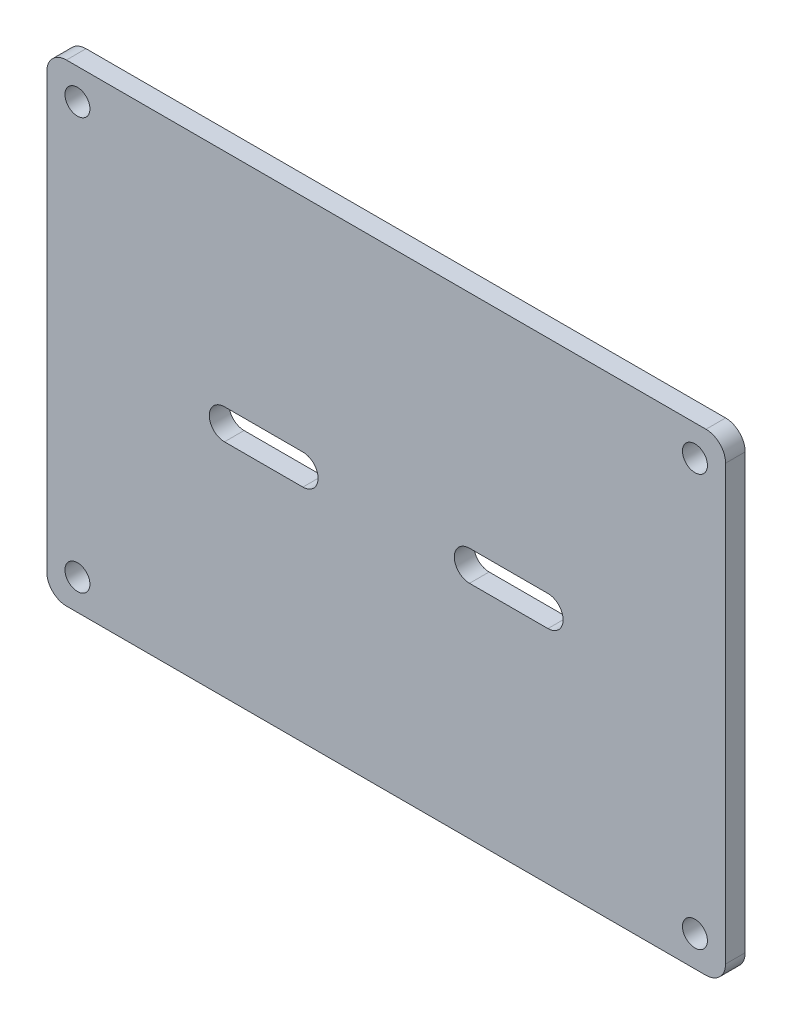
ISO-10303-21;
HEADER;
FILE_DESCRIPTION(('STEP AP214'),'2;1');
FILE_NAME('part.step','',(''),(''),'','','');
FILE_SCHEMA(('AUTOMOTIVE_DESIGN { 1 0 10303 214 1 1 1 1 }'));
ENDSEC;
DATA;
#1=APPLICATION_CONTEXT('core data for automotive mechanical design processes');
#2=APPLICATION_PROTOCOL_DEFINITION('international standard','automotive_design',2000,#1);
#3=PRODUCT_CONTEXT('',#1,'mechanical');
#4=PRODUCT('Part','Part','',(#3));
#5=PRODUCT_RELATED_PRODUCT_CATEGORY('part','',(#4));
#6=PRODUCT_DEFINITION_FORMATION('','',#4);
#7=PRODUCT_DEFINITION_CONTEXT('part definition',#1,'design');
#8=PRODUCT_DEFINITION('design','',#6,#7);
#9=PRODUCT_DEFINITION_SHAPE('','',#8);
#10=(LENGTH_UNIT() NAMED_UNIT(*) SI_UNIT(.MILLI.,.METRE.));
#11=(NAMED_UNIT(*) PLANE_ANGLE_UNIT() SI_UNIT($,.RADIAN.));
#12=(NAMED_UNIT(*) SI_UNIT($,.STERADIAN.) SOLID_ANGLE_UNIT());
#13=UNCERTAINTY_MEASURE_WITH_UNIT(LENGTH_MEASURE(1.E-05),#10,'distance_accuracy_value','');
#14=(GEOMETRIC_REPRESENTATION_CONTEXT(3) GLOBAL_UNCERTAINTY_ASSIGNED_CONTEXT((#13)) GLOBAL_UNIT_ASSIGNED_CONTEXT((#10,
#11,#12)) REPRESENTATION_CONTEXT('',''));
#15=CARTESIAN_POINT('',(0.,0.,0.));
#16=DIRECTION('',(0.,0.,1.));
#17=DIRECTION('',(1.,0.,0.));
#18=AXIS2_PLACEMENT_3D('',#15,#16,#17);
#19=CARTESIAN_POINT('',(0.,0.,2.));
#20=DIRECTION('',(0.,0.,1.));
#21=DIRECTION('',(1.,0.,0.));
#22=AXIS2_PLACEMENT_3D('',#19,#20,#21);
#23=PLANE('',#22);
#24=CARTESIAN_POINT('',(-31.5,-21.,2.));
#25=DIRECTION('',(0.,0.,1.));
#26=DIRECTION('',(1.,0.,0.));
#27=AXIS2_PLACEMENT_3D('',#24,#25,#26);
#28=CIRCLE('',#27,1.275);
#29=CARTESIAN_POINT('',(-30.225,-21.,2.));
#30=VERTEX_POINT('',#29);
#31=EDGE_CURVE('E228',#30,#30,#28,.T.);
#32=ORIENTED_EDGE('',*,*,#31,.F.);
#33=EDGE_LOOP('',(#32));
#34=FACE_BOUND('',#33,.T.);
#35=CARTESIAN_POINT('',(-31.5,21.,2.));
#36=DIRECTION('',(0.,0.,1.));
#37=DIRECTION('',(1.,0.,0.));
#38=AXIS2_PLACEMENT_3D('',#35,#36,#37);
#39=CIRCLE('',#38,1.275);
#40=CARTESIAN_POINT('',(-30.225,21.,2.));
#41=VERTEX_POINT('',#40);
#42=EDGE_CURVE('E240',#41,#41,#39,.T.);
#43=ORIENTED_EDGE('',*,*,#42,.F.);
#44=EDGE_LOOP('',(#43));
#45=FACE_BOUND('',#44,.T.);
#46=DIRECTION('',(-1.,0.,0.));
#47=VECTOR('',#46,1.);
#48=CARTESIAN_POINT('',(34.625,24.125,2.));
#49=LINE('',#48,#47);
#50=CARTESIAN_POINT('',(32.625,24.125,2.));
#51=VERTEX_POINT('',#50);
#52=CARTESIAN_POINT('',(-32.625,24.125,2.));
#53=VERTEX_POINT('',#52);
#54=EDGE_CURVE('E254',#51,#53,#49,.T.);
#55=ORIENTED_EDGE('',*,*,#54,.T.);
#56=CARTESIAN_POINT('',(-32.625,22.125,2.));
#57=DIRECTION('',(0.,0.,1.));
#58=DIRECTION('',(1.,0.,0.));
#59=AXIS2_PLACEMENT_3D('',#56,#57,#58);
#60=CIRCLE('',#59,2.);
#61=CARTESIAN_POINT('',(-34.625,22.125,2.));
#62=VERTEX_POINT('',#61);
#63=EDGE_CURVE('E289',#53,#62,#60,.T.);
#64=ORIENTED_EDGE('',*,*,#63,.T.);
#65=DIRECTION('',(0.,-1.,0.));
#66=VECTOR('',#65,1.);
#67=CARTESIAN_POINT('',(-34.625,-24.125,2.));
#68=LINE('',#67,#66);
#69=CARTESIAN_POINT('',(-34.625,-22.125,2.));
#70=VERTEX_POINT('',#69);
#71=EDGE_CURVE('E246',#62,#70,#68,.T.);
#72=ORIENTED_EDGE('',*,*,#71,.T.);
#73=CARTESIAN_POINT('',(-32.625,-22.125,2.));
#74=DIRECTION('',(0.,0.,1.));
#75=DIRECTION('',(1.,0.,0.));
#76=AXIS2_PLACEMENT_3D('',#73,#74,#75);
#77=CIRCLE('',#76,2.);
#78=CARTESIAN_POINT('',(-32.625,-24.125,2.));
#79=VERTEX_POINT('',#78);
#80=EDGE_CURVE('E286',#70,#79,#77,.T.);
#81=ORIENTED_EDGE('',*,*,#80,.T.);
#82=DIRECTION('',(1.,0.,0.));
#83=VECTOR('',#82,1.);
#84=CARTESIAN_POINT('',(34.625,-24.125,2.));
#85=LINE('',#84,#83);
#86=CARTESIAN_POINT('',(32.625,-24.125,2.));
#87=VERTEX_POINT('',#86);
#88=EDGE_CURVE('E249',#79,#87,#85,.T.);
#89=ORIENTED_EDGE('',*,*,#88,.T.);
#90=CARTESIAN_POINT('',(32.625,-22.125,2.));
#91=DIRECTION('',(0.,0.,1.));
#92=DIRECTION('',(1.,0.,0.));
#93=AXIS2_PLACEMENT_3D('',#90,#91,#92);
#94=CIRCLE('',#93,2.);
#95=CARTESIAN_POINT('',(34.625,-22.125,2.));
#96=VERTEX_POINT('',#95);
#97=EDGE_CURVE('E57',#87,#96,#94,.T.);
#98=ORIENTED_EDGE('',*,*,#97,.T.);
#99=DIRECTION('',(0.,1.,0.));
#100=VECTOR('',#99,1.);
#101=CARTESIAN_POINT('',(34.625,-24.125,2.));
#102=LINE('',#101,#100);
#103=CARTESIAN_POINT('',(34.625,22.125,2.));
#104=VERTEX_POINT('',#103);
#105=EDGE_CURVE('E252',#96,#104,#102,.T.);
#106=ORIENTED_EDGE('',*,*,#105,.T.);
#107=CARTESIAN_POINT('',(32.625,22.125,2.));
#108=DIRECTION('',(0.,0.,1.));
#109=DIRECTION('',(1.,0.,0.));
#110=AXIS2_PLACEMENT_3D('',#107,#108,#109);
#111=CIRCLE('',#110,2.);
#112=EDGE_CURVE('E284',#104,#51,#111,.T.);
#113=ORIENTED_EDGE('',*,*,#112,.T.);
#114=EDGE_LOOP('',(#55,#64,#72,#81,#89,#98,#106,#113));
#115=FACE_BOUND('',#114,.T.);
#116=CARTESIAN_POINT('',(31.5,21.,2.));
#117=DIRECTION('',(0.,0.,1.));
#118=DIRECTION('',(1.,0.,0.));
#119=AXIS2_PLACEMENT_3D('',#116,#117,#118);
#120=CIRCLE('',#119,1.275);
#121=CARTESIAN_POINT('',(32.775,21.,2.));
#122=VERTEX_POINT('',#121);
#123=EDGE_CURVE('E234',#122,#122,#120,.T.);
#124=ORIENTED_EDGE('',*,*,#123,.F.);
#125=EDGE_LOOP('',(#124));
#126=FACE_BOUND('',#125,.T.);
#127=CARTESIAN_POINT('',(31.5,-21.,2.));
#128=DIRECTION('',(0.,0.,1.));
#129=DIRECTION('',(1.,0.,0.));
#130=AXIS2_PLACEMENT_3D('',#127,#128,#129);
#131=CIRCLE('',#130,1.275);
#132=CARTESIAN_POINT('',(32.775,-21.,2.));
#133=VERTEX_POINT('',#132);
#134=EDGE_CURVE('E222',#133,#133,#131,.T.);
#135=ORIENTED_EDGE('',*,*,#134,.F.);
#136=EDGE_LOOP('',(#135));
#137=FACE_BOUND('',#136,.T.);
#138=DIRECTION('',(1.,0.,0.));
#139=VECTOR('',#138,1.);
#140=CARTESIAN_POINT('',(-16.5,-1.55,2.));
#141=LINE('',#140,#139);
#142=CARTESIAN_POINT('',(-16.5,-1.55,2.));
#143=VERTEX_POINT('',#142);
#144=CARTESIAN_POINT('',(-8.5,-1.55,2.));
#145=VERTEX_POINT('',#144);
#146=EDGE_CURVE('E193',#143,#145,#141,.T.);
#147=ORIENTED_EDGE('',*,*,#146,.F.);
#148=CARTESIAN_POINT('',(-16.5,0.,2.));
#149=DIRECTION('',(0.,0.,1.));
#150=DIRECTION('',(1.,0.,0.));
#151=AXIS2_PLACEMENT_3D('',#148,#149,#150);
#152=CIRCLE('',#151,1.55);
#153=CARTESIAN_POINT('',(-16.5,1.55,2.));
#154=VERTEX_POINT('',#153);
#155=EDGE_CURVE('E191',#154,#143,#152,.T.);
#156=ORIENTED_EDGE('',*,*,#155,.F.);
#157=DIRECTION('',(-1.,0.,0.));
#158=VECTOR('',#157,1.);
#159=CARTESIAN_POINT('',(-16.5,1.55,2.));
#160=LINE('',#159,#158);
#161=CARTESIAN_POINT('',(-8.5,1.55,2.));
#162=VERTEX_POINT('',#161);
#163=EDGE_CURVE('E199',#162,#154,#160,.T.);
#164=ORIENTED_EDGE('',*,*,#163,.F.);
#165=CARTESIAN_POINT('',(-8.5,0.,2.));
#166=DIRECTION('',(0.,0.,1.));
#167=DIRECTION('',(1.,0.,0.));
#168=AXIS2_PLACEMENT_3D('',#165,#166,#167);
#169=CIRCLE('',#168,1.55);
#170=EDGE_CURVE('E196',#145,#162,#169,.T.);
#171=ORIENTED_EDGE('',*,*,#170,.F.);
#172=EDGE_LOOP('',(#147,#156,#164,#171));
#173=FACE_BOUND('',#172,.T.);
#174=DIRECTION('',(-1.,0.,0.));
#175=VECTOR('',#174,1.);
#176=CARTESIAN_POINT('',(16.5,1.55,2.));
#177=LINE('',#176,#175);
#178=CARTESIAN_POINT('',(16.5,1.55,2.));
#179=VERTEX_POINT('',#178);
#180=CARTESIAN_POINT('',(8.5,1.55,2.));
#181=VERTEX_POINT('',#180);
#182=EDGE_CURVE('E160',#179,#181,#177,.T.);
#183=ORIENTED_EDGE('',*,*,#182,.F.);
#184=CARTESIAN_POINT('',(16.5,0.,2.));
#185=DIRECTION('',(0.,0.,1.));
#186=DIRECTION('',(1.,0.,0.));
#187=AXIS2_PLACEMENT_3D('',#184,#185,#186);
#188=CIRCLE('',#187,1.55);
#189=CARTESIAN_POINT('',(16.5,-1.55,2.));
#190=VERTEX_POINT('',#189);
#191=EDGE_CURVE('E150',#190,#179,#188,.T.);
#192=ORIENTED_EDGE('',*,*,#191,.F.);
#193=DIRECTION('',(1.,0.,0.));
#194=VECTOR('',#193,1.);
#195=CARTESIAN_POINT('',(16.5,-1.55,2.));
#196=LINE('',#195,#194);
#197=CARTESIAN_POINT('',(8.5,-1.55,2.));
#198=VERTEX_POINT('',#197);
#199=EDGE_CURVE('E175',#198,#190,#196,.T.);
#200=ORIENTED_EDGE('',*,*,#199,.F.);
#201=CARTESIAN_POINT('',(8.5,0.,2.));
#202=DIRECTION('',(0.,0.,1.));
#203=DIRECTION('',(1.,0.,0.));
#204=AXIS2_PLACEMENT_3D('',#201,#202,#203);
#205=CIRCLE('',#204,1.55);
#206=EDGE_CURVE('E173',#181,#198,#205,.T.);
#207=ORIENTED_EDGE('',*,*,#206,.F.);
#208=EDGE_LOOP('',(#183,#192,#200,#207));
#209=FACE_BOUND('',#208,.T.);
#210=ADVANCED_FACE('F35',(#34,#45,#115,#126,#137,#173,#209),#23,.T.);
#211=CARTESIAN_POINT('',(0.,0.,0.));
#212=DIRECTION('',(0.,0.,1.));
#213=DIRECTION('',(1.,0.,0.));
#214=AXIS2_PLACEMENT_3D('',#211,#212,#213);
#215=PLANE('',#214);
#216=CARTESIAN_POINT('',(-16.5,0.,0.));
#217=DIRECTION('',(0.,0.,1.));
#218=DIRECTION('',(1.,0.,0.));
#219=AXIS2_PLACEMENT_3D('',#216,#217,#218);
#220=CIRCLE('',#219,1.55);
#221=CARTESIAN_POINT('',(-16.5,1.55,0.));
#222=VERTEX_POINT('',#221);
#223=CARTESIAN_POINT('',(-16.5,-1.55,0.));
#224=VERTEX_POINT('',#223);
#225=EDGE_CURVE('E168',#222,#224,#220,.T.);
#226=ORIENTED_EDGE('',*,*,#225,.T.);
#227=DIRECTION('',(1.,0.,0.));
#228=VECTOR('',#227,1.);
#229=CARTESIAN_POINT('',(-16.5,-1.55,0.));
#230=LINE('',#229,#228);
#231=CARTESIAN_POINT('',(-8.5,-1.55,0.));
#232=VERTEX_POINT('',#231);
#233=EDGE_CURVE('E204',#224,#232,#230,.T.);
#234=ORIENTED_EDGE('',*,*,#233,.T.);
#235=CARTESIAN_POINT('',(-8.5,0.,0.));
#236=DIRECTION('',(0.,0.,1.));
#237=DIRECTION('',(1.,0.,0.));
#238=AXIS2_PLACEMENT_3D('',#235,#236,#237);
#239=CIRCLE('',#238,1.55);
#240=CARTESIAN_POINT('',(-8.5,1.55,0.));
#241=VERTEX_POINT('',#240);
#242=EDGE_CURVE('E207',#232,#241,#239,.T.);
#243=ORIENTED_EDGE('',*,*,#242,.T.);
#244=DIRECTION('',(-1.,0.,0.));
#245=VECTOR('',#244,1.);
#246=CARTESIAN_POINT('',(-16.5,1.55,0.));
#247=LINE('',#246,#245);
#248=EDGE_CURVE('E194',#241,#222,#247,.T.);
#249=ORIENTED_EDGE('',*,*,#248,.T.);
#250=EDGE_LOOP('',(#226,#234,#243,#249));
#251=FACE_BOUND('',#250,.T.);
#252=DIRECTION('',(0.,-1.,0.));
#253=VECTOR('',#252,1.);
#254=CARTESIAN_POINT('',(-34.625,-24.125,0.));
#255=LINE('',#254,#253);
#256=CARTESIAN_POINT('',(-34.625,22.125,0.));
#257=VERTEX_POINT('',#256);
#258=CARTESIAN_POINT('',(-34.625,-22.125,0.));
#259=VERTEX_POINT('',#258);
#260=EDGE_CURVE('E243',#257,#259,#255,.T.);
#261=ORIENTED_EDGE('',*,*,#260,.F.);
#262=CARTESIAN_POINT('',(-32.625,22.125,0.));
#263=DIRECTION('',(0.,0.,1.));
#264=DIRECTION('',(1.,0.,0.));
#265=AXIS2_PLACEMENT_3D('',#262,#263,#264);
#266=CIRCLE('',#265,2.);
#267=CARTESIAN_POINT('',(-32.625,24.125,0.));
#268=VERTEX_POINT('',#267);
#269=EDGE_CURVE('E277',#257,#268,#266,.F.);
#270=ORIENTED_EDGE('',*,*,#269,.T.);
#271=DIRECTION('',(-1.,0.,0.));
#272=VECTOR('',#271,1.);
#273=CARTESIAN_POINT('',(34.625,24.125,0.));
#274=LINE('',#273,#272);
#275=CARTESIAN_POINT('',(32.625,24.125,0.));
#276=VERTEX_POINT('',#275);
#277=EDGE_CURVE('E250',#276,#268,#274,.T.);
#278=ORIENTED_EDGE('',*,*,#277,.F.);
#279=CARTESIAN_POINT('',(32.625,22.125,0.));
#280=DIRECTION('',(0.,0.,1.));
#281=DIRECTION('',(1.,0.,0.));
#282=AXIS2_PLACEMENT_3D('',#279,#280,#281);
#283=CIRCLE('',#282,2.);
#284=CARTESIAN_POINT('',(34.625,22.125,0.));
#285=VERTEX_POINT('',#284);
#286=EDGE_CURVE('E271',#276,#285,#283,.F.);
#287=ORIENTED_EDGE('',*,*,#286,.T.);
#288=DIRECTION('',(0.,1.,0.));
#289=VECTOR('',#288,1.);
#290=CARTESIAN_POINT('',(34.625,-24.125,0.));
#291=LINE('',#290,#289);
#292=CARTESIAN_POINT('',(34.625,-22.125,0.));
#293=VERTEX_POINT('',#292);
#294=EDGE_CURVE('E263',#293,#285,#291,.T.);
#295=ORIENTED_EDGE('',*,*,#294,.F.);
#296=CARTESIAN_POINT('',(32.625,-22.125,0.));
#297=DIRECTION('',(0.,0.,1.));
#298=DIRECTION('',(1.,0.,0.));
#299=AXIS2_PLACEMENT_3D('',#296,#297,#298);
#300=CIRCLE('',#299,2.);
#301=CARTESIAN_POINT('',(32.625,-24.125,0.));
#302=VERTEX_POINT('',#301);
#303=EDGE_CURVE('E275',#293,#302,#300,.F.);
#304=ORIENTED_EDGE('',*,*,#303,.T.);
#305=DIRECTION('',(1.,0.,0.));
#306=VECTOR('',#305,1.);
#307=CARTESIAN_POINT('',(34.625,-24.125,0.));
#308=LINE('',#307,#306);
#309=CARTESIAN_POINT('',(-32.625,-24.125,0.));
#310=VERTEX_POINT('',#309);
#311=EDGE_CURVE('E260',#310,#302,#308,.T.);
#312=ORIENTED_EDGE('',*,*,#311,.F.);
#313=CARTESIAN_POINT('',(-32.625,-22.125,0.));
#314=DIRECTION('',(0.,0.,1.));
#315=DIRECTION('',(1.,0.,0.));
#316=AXIS2_PLACEMENT_3D('',#313,#314,#315);
#317=CIRCLE('',#316,2.);
#318=EDGE_CURVE('E273',#310,#259,#317,.F.);
#319=ORIENTED_EDGE('',*,*,#318,.T.);
#320=EDGE_LOOP('',(#261,#270,#278,#287,#295,#304,#312,#319));
#321=FACE_BOUND('',#320,.T.);
#322=CARTESIAN_POINT('',(-31.5,21.,0.));
#323=DIRECTION('',(0.,0.,1.));
#324=DIRECTION('',(1.,0.,0.));
#325=AXIS2_PLACEMENT_3D('',#322,#323,#324);
#326=CIRCLE('',#325,1.275);
#327=CARTESIAN_POINT('',(-30.225,21.,0.));
#328=VERTEX_POINT('',#327);
#329=EDGE_CURVE('E237',#328,#328,#326,.T.);
#330=ORIENTED_EDGE('',*,*,#329,.T.);
#331=EDGE_LOOP('',(#330));
#332=FACE_BOUND('',#331,.T.);
#333=CARTESIAN_POINT('',(31.5,21.,0.));
#334=DIRECTION('',(0.,0.,1.));
#335=DIRECTION('',(1.,0.,0.));
#336=AXIS2_PLACEMENT_3D('',#333,#334,#335);
#337=CIRCLE('',#336,1.275);
#338=CARTESIAN_POINT('',(32.775,21.,0.));
#339=VERTEX_POINT('',#338);
#340=EDGE_CURVE('E231',#339,#339,#337,.T.);
#341=ORIENTED_EDGE('',*,*,#340,.T.);
#342=EDGE_LOOP('',(#341));
#343=FACE_BOUND('',#342,.T.);
#344=CARTESIAN_POINT('',(-31.5,-21.,0.));
#345=DIRECTION('',(0.,0.,1.));
#346=DIRECTION('',(1.,0.,0.));
#347=AXIS2_PLACEMENT_3D('',#344,#345,#346);
#348=CIRCLE('',#347,1.275);
#349=CARTESIAN_POINT('',(-30.225,-21.,0.));
#350=VERTEX_POINT('',#349);
#351=EDGE_CURVE('E225',#350,#350,#348,.T.);
#352=ORIENTED_EDGE('',*,*,#351,.T.);
#353=EDGE_LOOP('',(#352));
#354=FACE_BOUND('',#353,.T.);
#355=CARTESIAN_POINT('',(31.5,-21.,0.));
#356=DIRECTION('',(0.,0.,1.));
#357=DIRECTION('',(1.,0.,0.));
#358=AXIS2_PLACEMENT_3D('',#355,#356,#357);
#359=CIRCLE('',#358,1.275);
#360=CARTESIAN_POINT('',(32.775,-21.,0.));
#361=VERTEX_POINT('',#360);
#362=EDGE_CURVE('E221',#361,#361,#359,.T.);
#363=ORIENTED_EDGE('',*,*,#362,.T.);
#364=EDGE_LOOP('',(#363));
#365=FACE_BOUND('',#364,.T.);
#366=CARTESIAN_POINT('',(16.5,0.,0.));
#367=DIRECTION('',(0.,0.,1.));
#368=DIRECTION('',(1.,0.,0.));
#369=AXIS2_PLACEMENT_3D('',#366,#367,#368);
#370=CIRCLE('',#369,1.55);
#371=CARTESIAN_POINT('',(16.5,-1.55,0.));
#372=VERTEX_POINT('',#371);
#373=CARTESIAN_POINT('',(16.5,1.55,0.));
#374=VERTEX_POINT('',#373);
#375=EDGE_CURVE('E179',#372,#374,#370,.T.);
#376=ORIENTED_EDGE('',*,*,#375,.T.);
#377=DIRECTION('',(-1.,0.,0.));
#378=VECTOR('',#377,1.);
#379=CARTESIAN_POINT('',(16.5,1.55,0.));
#380=LINE('',#379,#378);
#381=CARTESIAN_POINT('',(8.5,1.55,0.));
#382=VERTEX_POINT('',#381);
#383=EDGE_CURVE('E167',#374,#382,#380,.T.);
#384=ORIENTED_EDGE('',*,*,#383,.T.);
#385=CARTESIAN_POINT('',(8.5,0.,0.));
#386=DIRECTION('',(0.,0.,1.));
#387=DIRECTION('',(1.,0.,0.));
#388=AXIS2_PLACEMENT_3D('',#385,#386,#387);
#389=CIRCLE('',#388,1.55);
#390=CARTESIAN_POINT('',(8.5,-1.55,0.));
#391=VERTEX_POINT('',#390);
#392=EDGE_CURVE('E182',#382,#391,#389,.T.);
#393=ORIENTED_EDGE('',*,*,#392,.T.);
#394=DIRECTION('',(1.,0.,0.));
#395=VECTOR('',#394,1.);
#396=CARTESIAN_POINT('',(16.5,-1.55,0.));
#397=LINE('',#396,#395);
#398=EDGE_CURVE('E161',#391,#372,#397,.T.);
#399=ORIENTED_EDGE('',*,*,#398,.T.);
#400=EDGE_LOOP('',(#376,#384,#393,#399));
#401=FACE_BOUND('',#400,.T.);
#402=ADVANCED_FACE('F305',(#251,#321,#332,#343,#354,#365,#401),#215,.F.);
#403=CARTESIAN_POINT('',(-34.625,-24.125,2.));
#404=DIRECTION('',(1.,0.,0.));
#405=DIRECTION('',(0.,0.,-1.));
#406=AXIS2_PLACEMENT_3D('',#403,#404,#405);
#407=PLANE('',#406);
#408=ORIENTED_EDGE('',*,*,#71,.F.);
#409=DIRECTION('',(0.,0.,-1.));
#410=VECTOR('',#409,1.);
#411=CARTESIAN_POINT('',(-34.625,22.125,2.));
#412=LINE('',#411,#410);
#413=EDGE_CURVE('E268',#62,#257,#412,.T.);
#414=ORIENTED_EDGE('',*,*,#413,.T.);
#415=ORIENTED_EDGE('',*,*,#260,.T.);
#416=DIRECTION('',(0.,0.,-1.));
#417=VECTOR('',#416,1.);
#418=CARTESIAN_POINT('',(-34.625,-22.125,2.));
#419=LINE('',#418,#417);
#420=EDGE_CURVE('E257',#259,#70,#419,.F.);
#421=ORIENTED_EDGE('',*,*,#420,.T.);
#422=EDGE_LOOP('',(#408,#414,#415,#421));
#423=FACE_BOUND('',#422,.T.);
#424=ADVANCED_FACE('F327',(#423),#407,.F.);
#425=CARTESIAN_POINT('',(34.625,-24.125,2.));
#426=DIRECTION('',(0.,1.,0.));
#427=DIRECTION('',(0.,0.,1.));
#428=AXIS2_PLACEMENT_3D('',#425,#426,#427);
#429=PLANE('',#428);
#430=ORIENTED_EDGE('',*,*,#311,.T.);
#431=DIRECTION('',(0.,0.,-1.));
#432=VECTOR('',#431,1.);
#433=CARTESIAN_POINT('',(32.625,-24.125,2.));
#434=LINE('',#433,#432);
#435=EDGE_CURVE('E11',#302,#87,#434,.F.);
#436=ORIENTED_EDGE('',*,*,#435,.T.);
#437=ORIENTED_EDGE('',*,*,#88,.F.);
#438=DIRECTION('',(0.,0.,-1.));
#439=VECTOR('',#438,1.);
#440=CARTESIAN_POINT('',(-32.625,-24.125,2.));
#441=LINE('',#440,#439);
#442=EDGE_CURVE('E43',#79,#310,#441,.T.);
#443=ORIENTED_EDGE('',*,*,#442,.T.);
#444=EDGE_LOOP('',(#430,#436,#437,#443));
#445=FACE_BOUND('',#444,.T.);
#446=ADVANCED_FACE('F299',(#445),#429,.F.);
#447=CARTESIAN_POINT('',(34.625,-24.125,2.));
#448=DIRECTION('',(-1.,0.,0.));
#449=DIRECTION('',(0.,0.,1.));
#450=AXIS2_PLACEMENT_3D('',#447,#448,#449);
#451=PLANE('',#450);
#452=ORIENTED_EDGE('',*,*,#105,.F.);
#453=DIRECTION('',(0.,0.,-1.));
#454=VECTOR('',#453,1.);
#455=CARTESIAN_POINT('',(34.625,-22.125,2.));
#456=LINE('',#455,#454);
#457=EDGE_CURVE('E292',#96,#293,#456,.T.);
#458=ORIENTED_EDGE('',*,*,#457,.T.);
#459=ORIENTED_EDGE('',*,*,#294,.T.);
#460=DIRECTION('',(0.,0.,-1.));
#461=VECTOR('',#460,1.);
#462=CARTESIAN_POINT('',(34.625,22.125,2.));
#463=LINE('',#462,#461);
#464=EDGE_CURVE('E50',#285,#104,#463,.F.);
#465=ORIENTED_EDGE('',*,*,#464,.T.);
#466=EDGE_LOOP('',(#452,#458,#459,#465));
#467=FACE_BOUND('',#466,.T.);
#468=ADVANCED_FACE('F311',(#467),#451,.F.);
#469=CARTESIAN_POINT('',(34.625,24.125,2.));
#470=DIRECTION('',(0.,-1.,0.));
#471=DIRECTION('',(0.,0.,-1.));
#472=AXIS2_PLACEMENT_3D('',#469,#470,#471);
#473=PLANE('',#472);
#474=ORIENTED_EDGE('',*,*,#277,.T.);
#475=DIRECTION('',(0.,0.,-1.));
#476=VECTOR('',#475,1.);
#477=CARTESIAN_POINT('',(-32.625,24.125,2.));
#478=LINE('',#477,#476);
#479=EDGE_CURVE('E282',#268,#53,#478,.F.);
#480=ORIENTED_EDGE('',*,*,#479,.T.);
#481=ORIENTED_EDGE('',*,*,#54,.F.);
#482=DIRECTION('',(0.,0.,-1.));
#483=VECTOR('',#482,1.);
#484=CARTESIAN_POINT('',(32.625,24.125,2.));
#485=LINE('',#484,#483);
#486=EDGE_CURVE('E279',#51,#276,#485,.T.);
#487=ORIENTED_EDGE('',*,*,#486,.T.);
#488=EDGE_LOOP('',(#474,#480,#481,#487));
#489=FACE_BOUND('',#488,.T.);
#490=ADVANCED_FACE('F319',(#489),#473,.F.);
#491=CARTESIAN_POINT('',(-31.5,21.,2.));
#492=DIRECTION('',(0.,0.,-1.));
#493=DIRECTION('',(-1.,0.,0.));
#494=AXIS2_PLACEMENT_3D('',#491,#492,#493);
#495=CYLINDRICAL_SURFACE('',#494,1.275);
#496=ORIENTED_EDGE('',*,*,#42,.T.);
#497=EDGE_LOOP('',(#496));
#498=FACE_BOUND('',#497,.T.);
#499=ORIENTED_EDGE('',*,*,#329,.F.);
#500=EDGE_LOOP('',(#499));
#501=FACE_BOUND('',#500,.T.);
#502=ADVANCED_FACE('F347',(#498,#501),#495,.F.);
#503=CARTESIAN_POINT('',(31.5,21.,2.));
#504=DIRECTION('',(0.,0.,-1.));
#505=DIRECTION('',(-1.,0.,0.));
#506=AXIS2_PLACEMENT_3D('',#503,#504,#505);
#507=CYLINDRICAL_SURFACE('',#506,1.275);
#508=ORIENTED_EDGE('',*,*,#123,.T.);
#509=EDGE_LOOP('',(#508));
#510=FACE_BOUND('',#509,.T.);
#511=ORIENTED_EDGE('',*,*,#340,.F.);
#512=EDGE_LOOP('',(#511));
#513=FACE_BOUND('',#512,.T.);
#514=ADVANCED_FACE('F399',(#510,#513),#507,.F.);
#515=CARTESIAN_POINT('',(-31.5,-21.,2.));
#516=DIRECTION('',(0.,0.,-1.));
#517=DIRECTION('',(-1.,0.,0.));
#518=AXIS2_PLACEMENT_3D('',#515,#516,#517);
#519=CYLINDRICAL_SURFACE('',#518,1.275);
#520=ORIENTED_EDGE('',*,*,#31,.T.);
#521=EDGE_LOOP('',(#520));
#522=FACE_BOUND('',#521,.T.);
#523=ORIENTED_EDGE('',*,*,#351,.F.);
#524=EDGE_LOOP('',(#523));
#525=FACE_BOUND('',#524,.T.);
#526=ADVANCED_FACE('F396',(#522,#525),#519,.F.);
#527=CARTESIAN_POINT('',(31.5,-21.,2.));
#528=DIRECTION('',(0.,0.,-1.));
#529=DIRECTION('',(-1.,0.,0.));
#530=AXIS2_PLACEMENT_3D('',#527,#528,#529);
#531=CYLINDRICAL_SURFACE('',#530,1.275);
#532=ORIENTED_EDGE('',*,*,#134,.T.);
#533=EDGE_LOOP('',(#532));
#534=FACE_BOUND('',#533,.T.);
#535=ORIENTED_EDGE('',*,*,#362,.F.);
#536=EDGE_LOOP('',(#535));
#537=FACE_BOUND('',#536,.T.);
#538=ADVANCED_FACE('F392',(#534,#537),#531,.F.);
#539=CARTESIAN_POINT('',(-16.5,0.,2.));
#540=DIRECTION('',(0.,0.,-1.));
#541=DIRECTION('',(-1.,0.,0.));
#542=AXIS2_PLACEMENT_3D('',#539,#540,#541);
#543=CYLINDRICAL_SURFACE('',#542,1.55);
#544=ORIENTED_EDGE('',*,*,#225,.F.);
#545=DIRECTION('',(0.,0.,-1.));
#546=VECTOR('',#545,1.);
#547=CARTESIAN_POINT('',(-16.5,1.55,2.));
#548=LINE('',#547,#546);
#549=EDGE_CURVE('E201',#154,#222,#548,.T.);
#550=ORIENTED_EDGE('',*,*,#549,.F.);
#551=ORIENTED_EDGE('',*,*,#155,.T.);
#552=DIRECTION('',(0.,0.,-1.));
#553=VECTOR('',#552,1.);
#554=CARTESIAN_POINT('',(-16.5,-1.55,2.));
#555=LINE('',#554,#553);
#556=EDGE_CURVE('E218',#143,#224,#555,.T.);
#557=ORIENTED_EDGE('',*,*,#556,.T.);
#558=EDGE_LOOP('',(#544,#550,#551,#557));
#559=FACE_BOUND('',#558,.T.);
#560=ADVANCED_FACE('F388',(#559),#543,.F.);
#561=CARTESIAN_POINT('',(-16.5,-1.55,2.));
#562=DIRECTION('',(0.,1.,0.));
#563=DIRECTION('',(-1.,0.,0.));
#564=AXIS2_PLACEMENT_3D('',#561,#562,#563);
#565=PLANE('',#564);
#566=ORIENTED_EDGE('',*,*,#233,.F.);
#567=ORIENTED_EDGE('',*,*,#556,.F.);
#568=ORIENTED_EDGE('',*,*,#146,.T.);
#569=DIRECTION('',(0.,0.,-1.));
#570=VECTOR('',#569,1.);
#571=CARTESIAN_POINT('',(-8.5,-1.55,2.));
#572=LINE('',#571,#570);
#573=EDGE_CURVE('E216',#145,#232,#572,.T.);
#574=ORIENTED_EDGE('',*,*,#573,.T.);
#575=EDGE_LOOP('',(#566,#567,#568,#574));
#576=FACE_BOUND('',#575,.T.);
#577=ADVANCED_FACE('F384',(#576),#565,.T.);
#578=CARTESIAN_POINT('',(-8.5,0.,2.));
#579=DIRECTION('',(0.,0.,-1.));
#580=DIRECTION('',(-1.,0.,0.));
#581=AXIS2_PLACEMENT_3D('',#578,#579,#580);
#582=CYLINDRICAL_SURFACE('',#581,1.55);
#583=ORIENTED_EDGE('',*,*,#242,.F.);
#584=ORIENTED_EDGE('',*,*,#573,.F.);
#585=ORIENTED_EDGE('',*,*,#170,.T.);
#586=DIRECTION('',(0.,0.,-1.));
#587=VECTOR('',#586,1.);
#588=CARTESIAN_POINT('',(-8.5,1.55,2.));
#589=LINE('',#588,#587);
#590=EDGE_CURVE('E214',#162,#241,#589,.T.);
#591=ORIENTED_EDGE('',*,*,#590,.T.);
#592=EDGE_LOOP('',(#583,#584,#585,#591));
#593=FACE_BOUND('',#592,.T.);
#594=ADVANCED_FACE('F380',(#593),#582,.F.);
#595=CARTESIAN_POINT('',(-16.5,1.55,2.));
#596=DIRECTION('',(0.,-1.,0.));
#597=DIRECTION('',(1.,0.,0.));
#598=AXIS2_PLACEMENT_3D('',#595,#596,#597);
#599=PLANE('',#598);
#600=ORIENTED_EDGE('',*,*,#248,.F.);
#601=ORIENTED_EDGE('',*,*,#590,.F.);
#602=ORIENTED_EDGE('',*,*,#163,.T.);
#603=ORIENTED_EDGE('',*,*,#549,.T.);
#604=EDGE_LOOP('',(#600,#601,#602,#603));
#605=FACE_BOUND('',#604,.T.);
#606=ADVANCED_FACE('F377',(#605),#599,.T.);
#607=CARTESIAN_POINT('',(16.5,0.,2.));
#608=DIRECTION('',(0.,0.,-1.));
#609=DIRECTION('',(-1.,0.,0.));
#610=AXIS2_PLACEMENT_3D('',#607,#608,#609);
#611=CYLINDRICAL_SURFACE('',#610,1.55);
#612=ORIENTED_EDGE('',*,*,#375,.F.);
#613=DIRECTION('',(0.,0.,-1.));
#614=VECTOR('',#613,1.);
#615=CARTESIAN_POINT('',(16.5,-1.55,2.));
#616=LINE('',#615,#614);
#617=EDGE_CURVE('E156',#190,#372,#616,.T.);
#618=ORIENTED_EDGE('',*,*,#617,.F.);
#619=ORIENTED_EDGE('',*,*,#191,.T.);
#620=DIRECTION('',(0.,0.,-1.));
#621=VECTOR('',#620,1.);
#622=CARTESIAN_POINT('',(16.5,1.55,2.));
#623=LINE('',#622,#621);
#624=EDGE_CURVE('E153',#179,#374,#623,.T.);
#625=ORIENTED_EDGE('',*,*,#624,.T.);
#626=EDGE_LOOP('',(#612,#618,#619,#625));
#627=FACE_BOUND('',#626,.T.);
#628=ADVANCED_FACE('F152',(#627),#611,.F.);
#629=CARTESIAN_POINT('',(16.5,1.55,2.));
#630=DIRECTION('',(0.,-1.,0.));
#631=DIRECTION('',(1.,0.,0.));
#632=AXIS2_PLACEMENT_3D('',#629,#630,#631);
#633=PLANE('',#632);
#634=ORIENTED_EDGE('',*,*,#383,.F.);
#635=ORIENTED_EDGE('',*,*,#624,.F.);
#636=ORIENTED_EDGE('',*,*,#182,.T.);
#637=DIRECTION('',(0.,0.,-1.));
#638=VECTOR('',#637,1.);
#639=CARTESIAN_POINT('',(8.5,1.55,2.));
#640=LINE('',#639,#638);
#641=EDGE_CURVE('E169',#181,#382,#640,.T.);
#642=ORIENTED_EDGE('',*,*,#641,.T.);
#643=EDGE_LOOP('',(#634,#635,#636,#642));
#644=FACE_BOUND('',#643,.T.);
#645=ADVANCED_FACE('F164',(#644),#633,.T.);
#646=CARTESIAN_POINT('',(8.5,0.,2.));
#647=DIRECTION('',(0.,0.,-1.));
#648=DIRECTION('',(-1.,0.,0.));
#649=AXIS2_PLACEMENT_3D('',#646,#647,#648);
#650=CYLINDRICAL_SURFACE('',#649,1.55);
#651=ORIENTED_EDGE('',*,*,#392,.F.);
#652=ORIENTED_EDGE('',*,*,#641,.F.);
#653=ORIENTED_EDGE('',*,*,#206,.T.);
#654=DIRECTION('',(0.,0.,-1.));
#655=VECTOR('',#654,1.);
#656=CARTESIAN_POINT('',(8.5,-1.55,2.));
#657=LINE('',#656,#655);
#658=EDGE_CURVE('E188',#198,#391,#657,.T.);
#659=ORIENTED_EDGE('',*,*,#658,.T.);
#660=EDGE_LOOP('',(#651,#652,#653,#659));
#661=FACE_BOUND('',#660,.T.);
#662=ADVANCED_FACE('F363',(#661),#650,.F.);
#663=CARTESIAN_POINT('',(16.5,-1.55,2.));
#664=DIRECTION('',(0.,1.,0.));
#665=DIRECTION('',(-1.,0.,0.));
#666=AXIS2_PLACEMENT_3D('',#663,#664,#665);
#667=PLANE('',#666);
#668=ORIENTED_EDGE('',*,*,#398,.F.);
#669=ORIENTED_EDGE('',*,*,#658,.F.);
#670=ORIENTED_EDGE('',*,*,#199,.T.);
#671=ORIENTED_EDGE('',*,*,#617,.T.);
#672=EDGE_LOOP('',(#668,#669,#670,#671));
#673=FACE_BOUND('',#672,.T.);
#674=ADVANCED_FACE('F359',(#673),#667,.T.);
#675=CARTESIAN_POINT('',(-32.625,22.125,2.));
#676=DIRECTION('',(0.,0.,-1.));
#677=DIRECTION('',(-1.,0.,0.));
#678=AXIS2_PLACEMENT_3D('',#675,#676,#677);
#679=CYLINDRICAL_SURFACE('',#678,2.);
#680=ORIENTED_EDGE('',*,*,#63,.F.);
#681=ORIENTED_EDGE('',*,*,#479,.F.);
#682=ORIENTED_EDGE('',*,*,#269,.F.);
#683=ORIENTED_EDGE('',*,*,#413,.F.);
#684=EDGE_LOOP('',(#680,#681,#682,#683));
#685=FACE_BOUND('',#684,.T.);
#686=ADVANCED_FACE('F324',(#685),#679,.T.);
#687=CARTESIAN_POINT('',(32.625,-22.125,2.));
#688=DIRECTION('',(0.,0.,-1.));
#689=DIRECTION('',(-1.,0.,0.));
#690=AXIS2_PLACEMENT_3D('',#687,#688,#689);
#691=CYLINDRICAL_SURFACE('',#690,2.);
#692=ORIENTED_EDGE('',*,*,#97,.F.);
#693=ORIENTED_EDGE('',*,*,#435,.F.);
#694=ORIENTED_EDGE('',*,*,#303,.F.);
#695=ORIENTED_EDGE('',*,*,#457,.F.);
#696=EDGE_LOOP('',(#692,#693,#694,#695));
#697=FACE_BOUND('',#696,.T.);
#698=ADVANCED_FACE('F310',(#697),#691,.T.);
#699=CARTESIAN_POINT('',(-32.625,-22.125,2.));
#700=DIRECTION('',(0.,0.,-1.));
#701=DIRECTION('',(-1.,0.,0.));
#702=AXIS2_PLACEMENT_3D('',#699,#700,#701);
#703=CYLINDRICAL_SURFACE('',#702,2.);
#704=ORIENTED_EDGE('',*,*,#80,.F.);
#705=ORIENTED_EDGE('',*,*,#420,.F.);
#706=ORIENTED_EDGE('',*,*,#318,.F.);
#707=ORIENTED_EDGE('',*,*,#442,.F.);
#708=EDGE_LOOP('',(#704,#705,#706,#707));
#709=FACE_BOUND('',#708,.T.);
#710=ADVANCED_FACE('F329',(#709),#703,.T.);
#711=CARTESIAN_POINT('',(32.625,22.125,2.));
#712=DIRECTION('',(0.,0.,-1.));
#713=DIRECTION('',(-1.,0.,0.));
#714=AXIS2_PLACEMENT_3D('',#711,#712,#713);
#715=CYLINDRICAL_SURFACE('',#714,2.);
#716=ORIENTED_EDGE('',*,*,#112,.F.);
#717=ORIENTED_EDGE('',*,*,#464,.F.);
#718=ORIENTED_EDGE('',*,*,#286,.F.);
#719=ORIENTED_EDGE('',*,*,#486,.F.);
#720=EDGE_LOOP('',(#716,#717,#718,#719));
#721=FACE_BOUND('',#720,.T.);
#722=ADVANCED_FACE('F37',(#721),#715,.T.);
#723=CLOSED_SHELL('',(#210,#402,#424,#446,#468,#490,#502,#514,#526,#538,#560,#577,#594,#606,
#628,#645,#662,#674,#686,#698,#710,#722));
#724=MANIFOLD_SOLID_BREP('B2',#723);
#725=ADVANCED_BREP_SHAPE_REPRESENTATION('',(#18,#724),#14);
#726=SHAPE_DEFINITION_REPRESENTATION(#9,#725);
ENDSEC;
END-ISO-10303-21;
